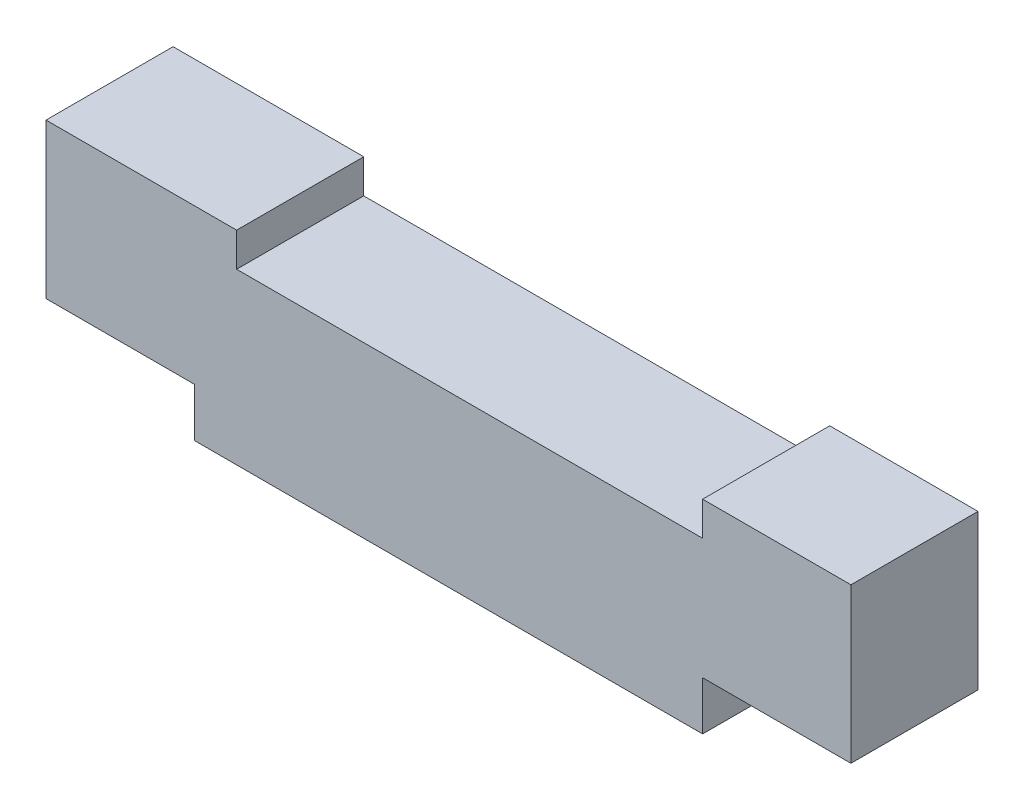
ISO-10303-21;
HEADER;
FILE_DESCRIPTION(('STEP AP214'),'2;1');
FILE_NAME('part.step','',(''),(''),'','','');
FILE_SCHEMA(('AUTOMOTIVE_DESIGN { 1 0 10303 214 1 1 1 1 }'));
ENDSEC;
DATA;
#1=APPLICATION_CONTEXT('core data for automotive mechanical design processes');
#2=APPLICATION_PROTOCOL_DEFINITION('international standard','automotive_design',2000,#1);
#3=PRODUCT_CONTEXT('',#1,'mechanical');
#4=PRODUCT('Part','Part','',(#3));
#5=PRODUCT_RELATED_PRODUCT_CATEGORY('part','',(#4));
#6=PRODUCT_DEFINITION_FORMATION('','',#4);
#7=PRODUCT_DEFINITION_CONTEXT('part definition',#1,'design');
#8=PRODUCT_DEFINITION('design','',#6,#7);
#9=PRODUCT_DEFINITION_SHAPE('','',#8);
#10=(LENGTH_UNIT() NAMED_UNIT(*) SI_UNIT(.MILLI.,.METRE.));
#11=(NAMED_UNIT(*) PLANE_ANGLE_UNIT() SI_UNIT($,.RADIAN.));
#12=(NAMED_UNIT(*) SI_UNIT($,.STERADIAN.) SOLID_ANGLE_UNIT());
#13=UNCERTAINTY_MEASURE_WITH_UNIT(LENGTH_MEASURE(1.E-05),#10,'distance_accuracy_value','');
#14=(GEOMETRIC_REPRESENTATION_CONTEXT(3) GLOBAL_UNCERTAINTY_ASSIGNED_CONTEXT((#13)) GLOBAL_UNIT_ASSIGNED_CONTEXT((#10,
#11,#12)) REPRESENTATION_CONTEXT('',''));
#15=CARTESIAN_POINT('',(0.,0.,0.));
#16=DIRECTION('',(0.,0.,1.));
#17=DIRECTION('',(1.,0.,0.));
#18=AXIS2_PLACEMENT_3D('',#15,#16,#17);
#19=CARTESIAN_POINT('',(-30.,0.,30.));
#20=DIRECTION('',(1.,0.,0.));
#21=DIRECTION('',(0.,0.,-1.));
#22=AXIS2_PLACEMENT_3D('',#19,#20,#21);
#23=PLANE('',#22);
#24=DIRECTION('',(0.,-1.,0.));
#25=VECTOR('',#24,1.);
#26=CARTESIAN_POINT('',(-30.,0.,0.));
#27=LINE('',#26,#25);
#28=CARTESIAN_POINT('',(-30.,11.5,0.));
#29=VERTEX_POINT('',#28);
#30=CARTESIAN_POINT('',(-30.,0.,0.));
#31=VERTEX_POINT('',#30);
#32=EDGE_CURVE('E151',#29,#31,#27,.T.);
#33=ORIENTED_EDGE('',*,*,#32,.T.);
#34=DIRECTION('',(0.,0.,-1.));
#35=VECTOR('',#34,1.);
#36=CARTESIAN_POINT('',(-30.,0.,30.));
#37=LINE('',#36,#35);
#38=CARTESIAN_POINT('',(-30.,0.,30.));
#39=VERTEX_POINT('',#38);
#40=EDGE_CURVE('E11',#39,#31,#37,.T.);
#41=ORIENTED_EDGE('',*,*,#40,.F.);
#42=DIRECTION('',(0.,-1.,0.));
#43=VECTOR('',#42,1.);
#44=CARTESIAN_POINT('',(-30.,0.,30.));
#45=LINE('',#44,#43);
#46=CARTESIAN_POINT('',(-30.,11.5,30.));
#47=VERTEX_POINT('',#46);
#48=EDGE_CURVE('E173',#47,#39,#45,.T.);
#49=ORIENTED_EDGE('',*,*,#48,.F.);
#50=DIRECTION('',(0.,0.,-1.));
#51=VECTOR('',#50,1.);
#52=CARTESIAN_POINT('',(-30.,11.5,30.));
#53=LINE('',#52,#51);
#54=EDGE_CURVE('E147',#47,#29,#53,.T.);
#55=ORIENTED_EDGE('',*,*,#54,.T.);
#56=EDGE_LOOP('',(#33,#41,#49,#55));
#57=FACE_BOUND('',#56,.T.);
#58=ADVANCED_FACE('F31',(#57),#23,.F.);
#59=CARTESIAN_POINT('',(90.,0.,30.));
#60=DIRECTION('',(0.,1.,0.));
#61=DIRECTION('',(0.,0.,1.));
#62=AXIS2_PLACEMENT_3D('',#59,#60,#61);
#63=PLANE('',#62);
#64=DIRECTION('',(1.,0.,0.));
#65=VECTOR('',#64,1.);
#66=CARTESIAN_POINT('',(90.,0.,0.));
#67=LINE('',#66,#65);
#68=CARTESIAN_POINT('',(90.,0.,0.));
#69=VERTEX_POINT('',#68);
#70=EDGE_CURVE('E154',#31,#69,#67,.T.);
#71=ORIENTED_EDGE('',*,*,#70,.T.);
#72=DIRECTION('',(0.,0.,-1.));
#73=VECTOR('',#72,1.);
#74=CARTESIAN_POINT('',(90.,0.,30.));
#75=LINE('',#74,#73);
#76=CARTESIAN_POINT('',(90.,0.,30.));
#77=VERTEX_POINT('',#76);
#78=EDGE_CURVE('E39',#77,#69,#75,.T.);
#79=ORIENTED_EDGE('',*,*,#78,.F.);
#80=DIRECTION('',(1.,0.,0.));
#81=VECTOR('',#80,1.);
#82=CARTESIAN_POINT('',(90.,0.,30.));
#83=LINE('',#82,#81);
#84=EDGE_CURVE('E102',#39,#77,#83,.T.);
#85=ORIENTED_EDGE('',*,*,#84,.F.);
#86=ORIENTED_EDGE('',*,*,#40,.T.);
#87=EDGE_LOOP('',(#71,#79,#85,#86));
#88=FACE_BOUND('',#87,.T.);
#89=ADVANCED_FACE('F251',(#88),#63,.F.);
#90=CARTESIAN_POINT('',(90.,0.,30.));
#91=DIRECTION('',(-1.,0.,0.));
#92=DIRECTION('',(0.,0.,1.));
#93=AXIS2_PLACEMENT_3D('',#90,#91,#92);
#94=PLANE('',#93);
#95=DIRECTION('',(0.,1.,0.));
#96=VECTOR('',#95,1.);
#97=CARTESIAN_POINT('',(90.,0.,0.));
#98=LINE('',#97,#96);
#99=CARTESIAN_POINT('',(90.,11.5,0.));
#100=VERTEX_POINT('',#99);
#101=EDGE_CURVE('E156',#69,#100,#98,.T.);
#102=ORIENTED_EDGE('',*,*,#101,.T.);
#103=DIRECTION('',(0.,0.,-1.));
#104=VECTOR('',#103,1.);
#105=CARTESIAN_POINT('',(90.,11.5,30.));
#106=LINE('',#105,#104);
#107=CARTESIAN_POINT('',(90.,11.5,30.));
#108=VERTEX_POINT('',#107);
#109=EDGE_CURVE('E192',#108,#100,#106,.T.);
#110=ORIENTED_EDGE('',*,*,#109,.F.);
#111=DIRECTION('',(0.,1.,0.));
#112=VECTOR('',#111,1.);
#113=CARTESIAN_POINT('',(90.,0.,30.));
#114=LINE('',#113,#112);
#115=EDGE_CURVE('E200',#77,#108,#114,.T.);
#116=ORIENTED_EDGE('',*,*,#115,.F.);
#117=ORIENTED_EDGE('',*,*,#78,.T.);
#118=EDGE_LOOP('',(#102,#110,#116,#117));
#119=FACE_BOUND('',#118,.T.);
#120=ADVANCED_FACE('F198',(#119),#94,.F.);
#121=CARTESIAN_POINT('',(90.,11.5,30.));
#122=DIRECTION('',(0.,1.,0.));
#123=DIRECTION('',(0.,0.,1.));
#124=AXIS2_PLACEMENT_3D('',#121,#122,#123);
#125=PLANE('',#124);
#126=DIRECTION('',(1.,0.,0.));
#127=VECTOR('',#126,1.);
#128=CARTESIAN_POINT('',(90.,11.5,0.));
#129=LINE('',#128,#127);
#130=CARTESIAN_POINT('',(125.,11.5,0.));
#131=VERTEX_POINT('',#130);
#132=EDGE_CURVE('E158',#100,#131,#129,.T.);
#133=ORIENTED_EDGE('',*,*,#132,.T.);
#134=DIRECTION('',(0.,0.,-1.));
#135=VECTOR('',#134,1.);
#136=CARTESIAN_POINT('',(125.,11.5,30.));
#137=LINE('',#136,#135);
#138=CARTESIAN_POINT('',(125.,11.5,30.));
#139=VERTEX_POINT('',#138);
#140=EDGE_CURVE('E189',#139,#131,#137,.T.);
#141=ORIENTED_EDGE('',*,*,#140,.F.);
#142=DIRECTION('',(1.,0.,0.));
#143=VECTOR('',#142,1.);
#144=CARTESIAN_POINT('',(90.,11.5,30.));
#145=LINE('',#144,#143);
#146=EDGE_CURVE('E218',#108,#139,#145,.T.);
#147=ORIENTED_EDGE('',*,*,#146,.F.);
#148=ORIENTED_EDGE('',*,*,#109,.T.);
#149=EDGE_LOOP('',(#133,#141,#147,#148));
#150=FACE_BOUND('',#149,.T.);
#151=ADVANCED_FACE('F209',(#150),#125,.F.);
#152=CARTESIAN_POINT('',(125.,11.5,30.));
#153=DIRECTION('',(-1.,0.,0.));
#154=DIRECTION('',(0.,0.,1.));
#155=AXIS2_PLACEMENT_3D('',#152,#153,#154);
#156=PLANE('',#155);
#157=DIRECTION('',(0.,1.,0.));
#158=VECTOR('',#157,1.);
#159=CARTESIAN_POINT('',(125.,11.5,0.));
#160=LINE('',#159,#158);
#161=CARTESIAN_POINT('',(125.,48.,0.));
#162=VERTEX_POINT('',#161);
#163=EDGE_CURVE('E160',#131,#162,#160,.T.);
#164=ORIENTED_EDGE('',*,*,#163,.T.);
#165=DIRECTION('',(0.,0.,-1.));
#166=VECTOR('',#165,1.);
#167=CARTESIAN_POINT('',(125.,48.,30.));
#168=LINE('',#167,#166);
#169=CARTESIAN_POINT('',(125.,48.,30.));
#170=VERTEX_POINT('',#169);
#171=EDGE_CURVE('E186',#170,#162,#168,.T.);
#172=ORIENTED_EDGE('',*,*,#171,.F.);
#173=DIRECTION('',(0.,1.,0.));
#174=VECTOR('',#173,1.);
#175=CARTESIAN_POINT('',(125.,11.5,30.));
#176=LINE('',#175,#174);
#177=EDGE_CURVE('E215',#139,#170,#176,.T.);
#178=ORIENTED_EDGE('',*,*,#177,.F.);
#179=ORIENTED_EDGE('',*,*,#140,.T.);
#180=EDGE_LOOP('',(#164,#172,#178,#179));
#181=FACE_BOUND('',#180,.T.);
#182=ADVANCED_FACE('F213',(#181),#156,.F.);
#183=CARTESIAN_POINT('',(90.,48.,30.));
#184=DIRECTION('',(0.,-1.,0.));
#185=DIRECTION('',(0.,0.,-1.));
#186=AXIS2_PLACEMENT_3D('',#183,#184,#185);
#187=PLANE('',#186);
#188=DIRECTION('',(-1.,0.,0.));
#189=VECTOR('',#188,1.);
#190=CARTESIAN_POINT('',(90.,48.,0.));
#191=LINE('',#190,#189);
#192=CARTESIAN_POINT('',(90.,48.,0.));
#193=VERTEX_POINT('',#192);
#194=EDGE_CURVE('E162',#162,#193,#191,.T.);
#195=ORIENTED_EDGE('',*,*,#194,.T.);
#196=DIRECTION('',(0.,0.,-1.));
#197=VECTOR('',#196,1.);
#198=CARTESIAN_POINT('',(90.,48.,30.));
#199=LINE('',#198,#197);
#200=CARTESIAN_POINT('',(90.,48.,30.));
#201=VERTEX_POINT('',#200);
#202=EDGE_CURVE('E183',#201,#193,#199,.T.);
#203=ORIENTED_EDGE('',*,*,#202,.F.);
#204=DIRECTION('',(-1.,0.,0.));
#205=VECTOR('',#204,1.);
#206=CARTESIAN_POINT('',(90.,48.,30.));
#207=LINE('',#206,#205);
#208=EDGE_CURVE('E217',#170,#201,#207,.T.);
#209=ORIENTED_EDGE('',*,*,#208,.F.);
#210=ORIENTED_EDGE('',*,*,#171,.T.);
#211=EDGE_LOOP('',(#195,#203,#209,#210));
#212=FACE_BOUND('',#211,.T.);
#213=ADVANCED_FACE('F264',(#212),#187,.F.);
#214=CARTESIAN_POINT('',(90.,40.,30.));
#215=DIRECTION('',(1.,0.,0.));
#216=DIRECTION('',(0.,0.,-1.));
#217=AXIS2_PLACEMENT_3D('',#214,#215,#216);
#218=PLANE('',#217);
#219=DIRECTION('',(0.,-1.,0.));
#220=VECTOR('',#219,1.);
#221=CARTESIAN_POINT('',(90.,40.,0.));
#222=LINE('',#221,#220);
#223=CARTESIAN_POINT('',(90.,40.,0.));
#224=VERTEX_POINT('',#223);
#225=EDGE_CURVE('E164',#193,#224,#222,.T.);
#226=ORIENTED_EDGE('',*,*,#225,.T.);
#227=DIRECTION('',(0.,0.,-1.));
#228=VECTOR('',#227,1.);
#229=CARTESIAN_POINT('',(90.,40.,30.));
#230=LINE('',#229,#228);
#231=CARTESIAN_POINT('',(90.,40.,30.));
#232=VERTEX_POINT('',#231);
#233=EDGE_CURVE('E180',#232,#224,#230,.T.);
#234=ORIENTED_EDGE('',*,*,#233,.F.);
#235=DIRECTION('',(0.,-1.,0.));
#236=VECTOR('',#235,1.);
#237=CARTESIAN_POINT('',(90.,40.,30.));
#238=LINE('',#237,#236);
#239=EDGE_CURVE('E220',#201,#232,#238,.T.);
#240=ORIENTED_EDGE('',*,*,#239,.F.);
#241=ORIENTED_EDGE('',*,*,#202,.T.);
#242=EDGE_LOOP('',(#226,#234,#240,#241));
#243=FACE_BOUND('',#242,.T.);
#244=ADVANCED_FACE('F267',(#243),#218,.F.);
#245=CARTESIAN_POINT('',(90.,40.,30.));
#246=DIRECTION('',(0.,-1.,0.));
#247=DIRECTION('',(0.,0.,-1.));
#248=AXIS2_PLACEMENT_3D('',#245,#246,#247);
#249=PLANE('',#248);
#250=DIRECTION('',(-1.,0.,0.));
#251=VECTOR('',#250,1.);
#252=CARTESIAN_POINT('',(90.,40.,0.));
#253=LINE('',#252,#251);
#254=CARTESIAN_POINT('',(-20.,40.,0.));
#255=VERTEX_POINT('',#254);
#256=EDGE_CURVE('E166',#224,#255,#253,.T.);
#257=ORIENTED_EDGE('',*,*,#256,.T.);
#258=DIRECTION('',(0.,0.,-1.));
#259=VECTOR('',#258,1.);
#260=CARTESIAN_POINT('',(-20.,40.,30.));
#261=LINE('',#260,#259);
#262=CARTESIAN_POINT('',(-20.,40.,30.));
#263=VERTEX_POINT('',#262);
#264=EDGE_CURVE('E177',#263,#255,#261,.T.);
#265=ORIENTED_EDGE('',*,*,#264,.F.);
#266=DIRECTION('',(-1.,0.,0.));
#267=VECTOR('',#266,1.);
#268=CARTESIAN_POINT('',(90.,40.,30.));
#269=LINE('',#268,#267);
#270=EDGE_CURVE('E226',#232,#263,#269,.T.);
#271=ORIENTED_EDGE('',*,*,#270,.F.);
#272=ORIENTED_EDGE('',*,*,#233,.T.);
#273=EDGE_LOOP('',(#257,#265,#271,#272));
#274=FACE_BOUND('',#273,.T.);
#275=ADVANCED_FACE('F232',(#274),#249,.F.);
#276=CARTESIAN_POINT('',(-20.,40.,30.));
#277=DIRECTION('',(-1.,0.,0.));
#278=DIRECTION('',(0.,0.,1.));
#279=AXIS2_PLACEMENT_3D('',#276,#277,#278);
#280=PLANE('',#279);
#281=DIRECTION('',(0.,1.,0.));
#282=VECTOR('',#281,1.);
#283=CARTESIAN_POINT('',(-20.,40.,0.));
#284=LINE('',#283,#282);
#285=CARTESIAN_POINT('',(-20.,48.,0.));
#286=VERTEX_POINT('',#285);
#287=EDGE_CURVE('E168',#255,#286,#284,.T.);
#288=ORIENTED_EDGE('',*,*,#287,.T.);
#289=DIRECTION('',(0.,0.,-1.));
#290=VECTOR('',#289,1.);
#291=CARTESIAN_POINT('',(-20.,48.,30.));
#292=LINE('',#291,#290);
#293=CARTESIAN_POINT('',(-20.,48.,30.));
#294=VERTEX_POINT('',#293);
#295=EDGE_CURVE('E142',#294,#286,#292,.T.);
#296=ORIENTED_EDGE('',*,*,#295,.F.);
#297=DIRECTION('',(0.,1.,0.));
#298=VECTOR('',#297,1.);
#299=CARTESIAN_POINT('',(-20.,40.,30.));
#300=LINE('',#299,#298);
#301=EDGE_CURVE('E133',#263,#294,#300,.T.);
#302=ORIENTED_EDGE('',*,*,#301,.F.);
#303=ORIENTED_EDGE('',*,*,#264,.T.);
#304=EDGE_LOOP('',(#288,#296,#302,#303));
#305=FACE_BOUND('',#304,.T.);
#306=ADVANCED_FACE('F236',(#305),#280,.F.);
#307=CARTESIAN_POINT('',(-65.,48.,30.));
#308=DIRECTION('',(0.,-1.,0.));
#309=DIRECTION('',(0.,0.,-1.));
#310=AXIS2_PLACEMENT_3D('',#307,#308,#309);
#311=PLANE('',#310);
#312=DIRECTION('',(-1.,0.,0.));
#313=VECTOR('',#312,1.);
#314=CARTESIAN_POINT('',(-65.,48.,0.));
#315=LINE('',#314,#313);
#316=CARTESIAN_POINT('',(-65.,48.,0.));
#317=VERTEX_POINT('',#316);
#318=EDGE_CURVE('E141',#286,#317,#315,.T.);
#319=ORIENTED_EDGE('',*,*,#318,.T.);
#320=DIRECTION('',(0.,0.,-1.));
#321=VECTOR('',#320,1.);
#322=CARTESIAN_POINT('',(-65.,48.,30.));
#323=LINE('',#322,#321);
#324=CARTESIAN_POINT('',(-65.,48.,30.));
#325=VERTEX_POINT('',#324);
#326=EDGE_CURVE('E138',#325,#317,#323,.T.);
#327=ORIENTED_EDGE('',*,*,#326,.F.);
#328=DIRECTION('',(-1.,0.,0.));
#329=VECTOR('',#328,1.);
#330=CARTESIAN_POINT('',(-65.,48.,30.));
#331=LINE('',#330,#329);
#332=EDGE_CURVE('E127',#294,#325,#331,.T.);
#333=ORIENTED_EDGE('',*,*,#332,.F.);
#334=ORIENTED_EDGE('',*,*,#295,.T.);
#335=EDGE_LOOP('',(#319,#327,#333,#334));
#336=FACE_BOUND('',#335,.T.);
#337=ADVANCED_FACE('F139',(#336),#311,.F.);
#338=CARTESIAN_POINT('',(-65.,11.5,30.));
#339=DIRECTION('',(1.,0.,0.));
#340=DIRECTION('',(0.,0.,-1.));
#341=AXIS2_PLACEMENT_3D('',#338,#339,#340);
#342=PLANE('',#341);
#343=DIRECTION('',(0.,-1.,0.));
#344=VECTOR('',#343,1.);
#345=CARTESIAN_POINT('',(-65.,11.5,0.));
#346=LINE('',#345,#344);
#347=CARTESIAN_POINT('',(-65.,11.5,0.));
#348=VERTEX_POINT('',#347);
#349=EDGE_CURVE('E88',#317,#348,#346,.T.);
#350=ORIENTED_EDGE('',*,*,#349,.T.);
#351=DIRECTION('',(0.,0.,-1.));
#352=VECTOR('',#351,1.);
#353=CARTESIAN_POINT('',(-65.,11.5,30.));
#354=LINE('',#353,#352);
#355=CARTESIAN_POINT('',(-65.,11.5,30.));
#356=VERTEX_POINT('',#355);
#357=EDGE_CURVE('E143',#356,#348,#354,.T.);
#358=ORIENTED_EDGE('',*,*,#357,.F.);
#359=DIRECTION('',(0.,-1.,0.));
#360=VECTOR('',#359,1.);
#361=CARTESIAN_POINT('',(-65.,11.5,30.));
#362=LINE('',#361,#360);
#363=EDGE_CURVE('E131',#325,#356,#362,.T.);
#364=ORIENTED_EDGE('',*,*,#363,.F.);
#365=ORIENTED_EDGE('',*,*,#326,.T.);
#366=EDGE_LOOP('',(#350,#358,#364,#365));
#367=FACE_BOUND('',#366,.T.);
#368=ADVANCED_FACE('F145',(#367),#342,.F.);
#369=CARTESIAN_POINT('',(-30.,11.5,30.));
#370=DIRECTION('',(0.,1.,0.));
#371=DIRECTION('',(0.,0.,1.));
#372=AXIS2_PLACEMENT_3D('',#369,#370,#371);
#373=PLANE('',#372);
#374=DIRECTION('',(1.,0.,0.));
#375=VECTOR('',#374,1.);
#376=CARTESIAN_POINT('',(-30.,11.5,0.));
#377=LINE('',#376,#375);
#378=EDGE_CURVE('E94',#348,#29,#377,.T.);
#379=ORIENTED_EDGE('',*,*,#378,.T.);
#380=ORIENTED_EDGE('',*,*,#54,.F.);
#381=DIRECTION('',(1.,0.,0.));
#382=VECTOR('',#381,1.);
#383=CARTESIAN_POINT('',(-30.,11.5,30.));
#384=LINE('',#383,#382);
#385=EDGE_CURVE('E47',#356,#47,#384,.T.);
#386=ORIENTED_EDGE('',*,*,#385,.F.);
#387=ORIENTED_EDGE('',*,*,#357,.T.);
#388=EDGE_LOOP('',(#379,#380,#386,#387));
#389=FACE_BOUND('',#388,.T.);
#390=ADVANCED_FACE('F240',(#389),#373,.F.);
#391=CARTESIAN_POINT('',(-30.,11.5,30.));
#392=DIRECTION('',(0.,0.,1.));
#393=DIRECTION('',(1.,0.,0.));
#394=AXIS2_PLACEMENT_3D('',#391,#392,#393);
#395=PLANE('',#394);
#396=ORIENTED_EDGE('',*,*,#48,.T.);
#397=ORIENTED_EDGE('',*,*,#84,.T.);
#398=ORIENTED_EDGE('',*,*,#115,.T.);
#399=ORIENTED_EDGE('',*,*,#146,.T.);
#400=ORIENTED_EDGE('',*,*,#177,.T.);
#401=ORIENTED_EDGE('',*,*,#208,.T.);
#402=ORIENTED_EDGE('',*,*,#239,.T.);
#403=ORIENTED_EDGE('',*,*,#270,.T.);
#404=ORIENTED_EDGE('',*,*,#301,.T.);
#405=ORIENTED_EDGE('',*,*,#332,.T.);
#406=ORIENTED_EDGE('',*,*,#363,.T.);
#407=ORIENTED_EDGE('',*,*,#385,.T.);
#408=EDGE_LOOP('',(#396,#397,#398,#399,#400,#401,#402,#403,#404,#405,#406,#407));
#409=FACE_BOUND('',#408,.T.);
#410=ADVANCED_FACE('F129',(#409),#395,.T.);
#411=CARTESIAN_POINT('',(-30.,11.5,0.));
#412=DIRECTION('',(0.,0.,1.));
#413=DIRECTION('',(1.,0.,0.));
#414=AXIS2_PLACEMENT_3D('',#411,#412,#413);
#415=PLANE('',#414);
#416=ORIENTED_EDGE('',*,*,#32,.F.);
#417=ORIENTED_EDGE('',*,*,#378,.F.);
#418=ORIENTED_EDGE('',*,*,#349,.F.);
#419=ORIENTED_EDGE('',*,*,#318,.F.);
#420=ORIENTED_EDGE('',*,*,#287,.F.);
#421=ORIENTED_EDGE('',*,*,#256,.F.);
#422=ORIENTED_EDGE('',*,*,#225,.F.);
#423=ORIENTED_EDGE('',*,*,#194,.F.);
#424=ORIENTED_EDGE('',*,*,#163,.F.);
#425=ORIENTED_EDGE('',*,*,#132,.F.);
#426=ORIENTED_EDGE('',*,*,#101,.F.);
#427=ORIENTED_EDGE('',*,*,#70,.F.);
#428=EDGE_LOOP('',(#416,#417,#418,#419,#420,#421,#422,#423,#424,#425,#426,#427));
#429=FACE_BOUND('',#428,.T.);
#430=ADVANCED_FACE('F204',(#429),#415,.F.);
#431=CLOSED_SHELL('',(#58,#89,#120,#151,#182,#213,#244,#275,#306,#337,#368,#390,#410,#430));
#432=MANIFOLD_SOLID_BREP('B2',#431);
#433=ADVANCED_BREP_SHAPE_REPRESENTATION('',(#18,#432),#14);
#434=SHAPE_DEFINITION_REPRESENTATION(#9,#433);
ENDSEC;
END-ISO-10303-21;
